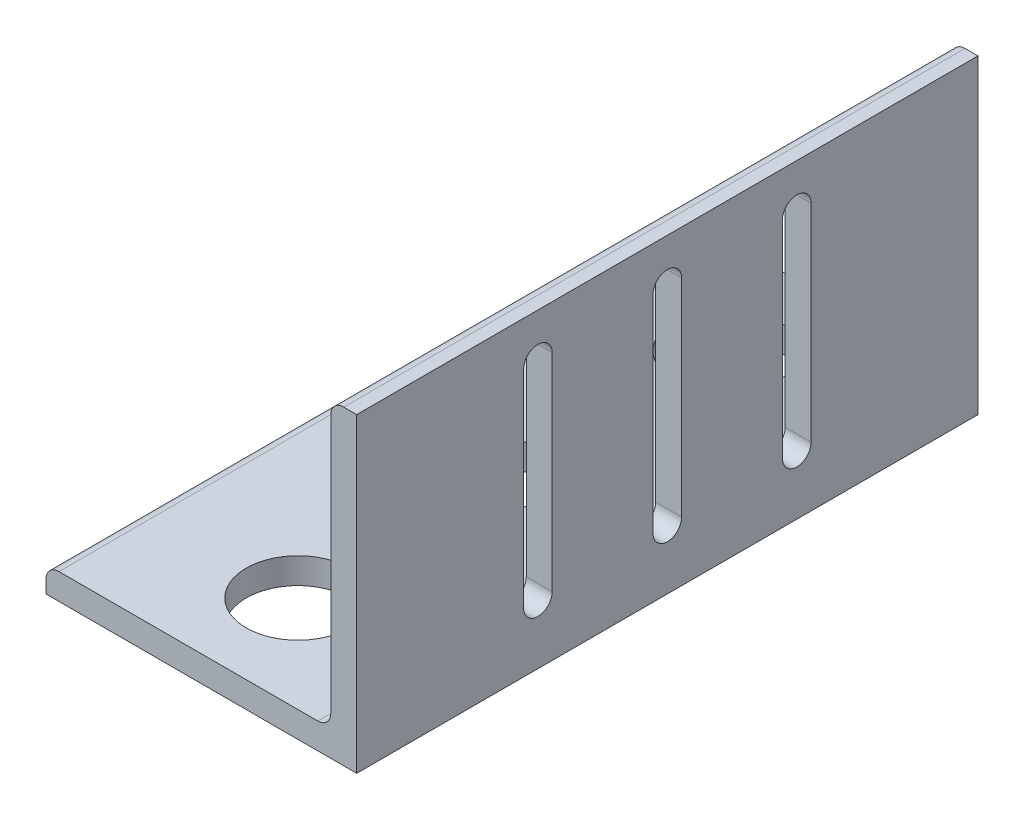
ISO-10303-21;
HEADER;
FILE_DESCRIPTION(('STEP AP214'),'2;1');
FILE_NAME('part.step','',(''),(''),'','','');
FILE_SCHEMA(('AUTOMOTIVE_DESIGN { 1 0 10303 214 1 1 1 1 }'));
ENDSEC;
DATA;
#1=APPLICATION_CONTEXT('core data for automotive mechanical design processes');
#2=APPLICATION_PROTOCOL_DEFINITION('international standard','automotive_design',2000,#1);
#3=PRODUCT_CONTEXT('',#1,'mechanical');
#4=PRODUCT('Part','Part','',(#3));
#5=PRODUCT_RELATED_PRODUCT_CATEGORY('part','',(#4));
#6=PRODUCT_DEFINITION_FORMATION('','',#4);
#7=PRODUCT_DEFINITION_CONTEXT('part definition',#1,'design');
#8=PRODUCT_DEFINITION('design','',#6,#7);
#9=PRODUCT_DEFINITION_SHAPE('','',#8);
#10=(LENGTH_UNIT() NAMED_UNIT(*) SI_UNIT(.MILLI.,.METRE.));
#11=(NAMED_UNIT(*) PLANE_ANGLE_UNIT() SI_UNIT($,.RADIAN.));
#12=(NAMED_UNIT(*) SI_UNIT($,.STERADIAN.) SOLID_ANGLE_UNIT());
#13=UNCERTAINTY_MEASURE_WITH_UNIT(LENGTH_MEASURE(1.E-05),#10,'distance_accuracy_value','');
#14=(GEOMETRIC_REPRESENTATION_CONTEXT(3) GLOBAL_UNCERTAINTY_ASSIGNED_CONTEXT((#13)) GLOBAL_UNIT_ASSIGNED_CONTEXT((#10,
#11,#12)) REPRESENTATION_CONTEXT('',''));
#15=CARTESIAN_POINT('',(0.,0.,0.));
#16=DIRECTION('',(0.,0.,1.));
#17=DIRECTION('',(1.,0.,0.));
#18=AXIS2_PLACEMENT_3D('',#15,#16,#17);
#19=CARTESIAN_POINT('',(-38.1,3.175,76.2));
#20=DIRECTION('',(1.,0.,0.));
#21=DIRECTION('',(0.,0.,-1.));
#22=AXIS2_PLACEMENT_3D('',#19,#20,#21);
#23=PLANE('',#22);
#24=DIRECTION('',(0.,-1.,0.));
#25=VECTOR('',#24,1.);
#26=CARTESIAN_POINT('',(-38.1,3.175,-76.2));
#27=LINE('',#26,#25);
#28=CARTESIAN_POINT('',(-38.1,3.175,-76.2));
#29=VERTEX_POINT('',#28);
#30=CARTESIAN_POINT('',(-38.1,0.,-76.2));
#31=VERTEX_POINT('',#30);
#32=EDGE_CURVE('E210',#29,#31,#27,.T.);
#33=ORIENTED_EDGE('',*,*,#32,.T.);
#34=DIRECTION('',(0.,0.,-1.));
#35=VECTOR('',#34,1.);
#36=CARTESIAN_POINT('',(-38.1,0.,76.2));
#37=LINE('',#36,#35);
#38=CARTESIAN_POINT('',(-38.1,0.,76.2));
#39=VERTEX_POINT('',#38);
#40=EDGE_CURVE('E312',#39,#31,#37,.T.);
#41=ORIENTED_EDGE('',*,*,#40,.F.);
#42=DIRECTION('',(0.,-1.,0.));
#43=VECTOR('',#42,1.);
#44=CARTESIAN_POINT('',(-38.1,3.175,76.2));
#45=LINE('',#44,#43);
#46=CARTESIAN_POINT('',(-38.1,3.175,76.2));
#47=VERTEX_POINT('',#46);
#48=EDGE_CURVE('E251',#47,#39,#45,.T.);
#49=ORIENTED_EDGE('',*,*,#48,.F.);
#50=DIRECTION('',(0.,0.,-1.));
#51=VECTOR('',#50,1.);
#52=CARTESIAN_POINT('',(-38.1,3.175,76.2));
#53=LINE('',#52,#51);
#54=EDGE_CURVE('E271',#47,#29,#53,.T.);
#55=ORIENTED_EDGE('',*,*,#54,.T.);
#56=EDGE_LOOP('',(#33,#41,#49,#55));
#57=FACE_BOUND('',#56,.T.);
#58=ADVANCED_FACE('F35',(#57),#23,.F.);
#59=CARTESIAN_POINT('',(-38.1,0.,76.2));
#60=DIRECTION('',(0.,1.,0.));
#61=DIRECTION('',(0.,0.,1.));
#62=AXIS2_PLACEMENT_3D('',#59,#60,#61);
#63=PLANE('',#62);
#64=CARTESIAN_POINT('',(0.,0.,-52.5));
#65=DIRECTION('',(0.,-1.,0.));
#66=DIRECTION('',(0.,0.,-1.));
#67=AXIS2_PLACEMENT_3D('',#64,#65,#66);
#68=CIRCLE('',#67,12.7);
#69=CARTESIAN_POINT('',(0.,0.,-65.2));
#70=VERTEX_POINT('',#69);
#71=EDGE_CURVE('E494',#70,#70,#68,.T.);
#72=ORIENTED_EDGE('',*,*,#71,.F.);
#73=EDGE_LOOP('',(#72));
#74=FACE_BOUND('',#73,.T.);
#75=CARTESIAN_POINT('',(0.,0.,52.5));
#76=DIRECTION('',(0.,-1.,0.));
#77=DIRECTION('',(0.,0.,-1.));
#78=AXIS2_PLACEMENT_3D('',#75,#76,#77);
#79=CIRCLE('',#78,12.7);
#80=CARTESIAN_POINT('',(0.,0.,39.8));
#81=VERTEX_POINT('',#80);
#82=EDGE_CURVE('E491',#81,#81,#79,.T.);
#83=ORIENTED_EDGE('',*,*,#82,.F.);
#84=EDGE_LOOP('',(#83));
#85=FACE_BOUND('',#84,.T.);
#86=CARTESIAN_POINT('',(0.,0.,0.));
#87=DIRECTION('',(0.,-1.,0.));
#88=DIRECTION('',(0.,0.,-1.));
#89=AXIS2_PLACEMENT_3D('',#86,#87,#88);
#90=CIRCLE('',#89,10.);
#91=CARTESIAN_POINT('',(0.,0.,-10.));
#92=VERTEX_POINT('',#91);
#93=EDGE_CURVE('E347',#92,#92,#90,.T.);
#94=ORIENTED_EDGE('',*,*,#93,.F.);
#95=EDGE_LOOP('',(#94));
#96=FACE_BOUND('',#95,.T.);
#97=DIRECTION('',(1.,0.,0.));
#98=VECTOR('',#97,1.);
#99=CARTESIAN_POINT('',(-38.1,0.,-76.2));
#100=LINE('',#99,#98);
#101=CARTESIAN_POINT('',(38.1,0.,-76.2));
#102=VERTEX_POINT('',#101);
#103=EDGE_CURVE('E274',#31,#102,#100,.T.);
#104=ORIENTED_EDGE('',*,*,#103,.T.);
#105=DIRECTION('',(0.,0.,-1.));
#106=VECTOR('',#105,1.);
#107=CARTESIAN_POINT('',(38.1,0.,76.2));
#108=LINE('',#107,#106);
#109=CARTESIAN_POINT('',(38.1,0.,76.2));
#110=VERTEX_POINT('',#109);
#111=EDGE_CURVE('E309',#110,#102,#108,.T.);
#112=ORIENTED_EDGE('',*,*,#111,.F.);
#113=DIRECTION('',(1.,0.,0.));
#114=VECTOR('',#113,1.);
#115=CARTESIAN_POINT('',(-38.1,0.,76.2));
#116=LINE('',#115,#114);
#117=EDGE_CURVE('E254',#39,#110,#116,.T.);
#118=ORIENTED_EDGE('',*,*,#117,.F.);
#119=ORIENTED_EDGE('',*,*,#40,.T.);
#120=EDGE_LOOP('',(#104,#112,#118,#119));
#121=FACE_BOUND('',#120,.T.);
#122=ADVANCED_FACE('F370',(#74,#85,#96,#121),#63,.F.);
#123=CARTESIAN_POINT('',(38.1,0.,76.2));
#124=DIRECTION('',(-1.,0.,0.));
#125=DIRECTION('',(0.,0.,1.));
#126=AXIS2_PLACEMENT_3D('',#123,#124,#125);
#127=PLANE('',#126);
#128=DIRECTION('',(0.,-1.,0.));
#129=VECTOR('',#128,1.);
#130=CARTESIAN_POINT('',(38.1,65.4,35.25));
#131=LINE('',#130,#129);
#132=CARTESIAN_POINT('',(38.1,65.4,35.25));
#133=VERTEX_POINT('',#132);
#134=CARTESIAN_POINT('',(38.1,14.6,35.25));
#135=VERTEX_POINT('',#134);
#136=EDGE_CURVE('E196',#133,#135,#131,.T.);
#137=ORIENTED_EDGE('',*,*,#136,.F.);
#138=CARTESIAN_POINT('',(38.1,65.4,31.75));
#139=DIRECTION('',(1.,0.,0.));
#140=DIRECTION('',(0.,1.,0.));
#141=AXIS2_PLACEMENT_3D('',#138,#139,#140);
#142=CIRCLE('',#141,3.5);
#143=CARTESIAN_POINT('',(38.1,65.4,28.25));
#144=VERTEX_POINT('',#143);
#145=EDGE_CURVE('E51',#144,#133,#142,.T.);
#146=ORIENTED_EDGE('',*,*,#145,.F.);
#147=DIRECTION('',(0.,1.,0.));
#148=VECTOR('',#147,1.);
#149=CARTESIAN_POINT('',(38.1,65.4,28.25));
#150=LINE('',#149,#148);
#151=CARTESIAN_POINT('',(38.1,14.6,28.25));
#152=VERTEX_POINT('',#151);
#153=EDGE_CURVE('E203',#152,#144,#150,.T.);
#154=ORIENTED_EDGE('',*,*,#153,.F.);
#155=CARTESIAN_POINT('',(38.1,14.6,31.75));
#156=DIRECTION('',(1.,0.,0.));
#157=DIRECTION('',(0.,1.,0.));
#158=AXIS2_PLACEMENT_3D('',#155,#156,#157);
#159=CIRCLE('',#158,3.5);
#160=EDGE_CURVE('E186',#135,#152,#159,.T.);
#161=ORIENTED_EDGE('',*,*,#160,.F.);
#162=EDGE_LOOP('',(#137,#146,#154,#161));
#163=FACE_BOUND('',#162,.T.);
#164=DIRECTION('',(0.,-1.,0.));
#165=VECTOR('',#164,1.);
#166=CARTESIAN_POINT('',(38.1,65.4,-28.25));
#167=LINE('',#166,#165);
#168=CARTESIAN_POINT('',(38.1,65.4,-28.25));
#169=VERTEX_POINT('',#168);
#170=CARTESIAN_POINT('',(38.1,14.6,-28.25));
#171=VERTEX_POINT('',#170);
#172=EDGE_CURVE('E214',#169,#171,#167,.T.);
#173=ORIENTED_EDGE('',*,*,#172,.F.);
#174=CARTESIAN_POINT('',(38.1,65.4,-31.75));
#175=DIRECTION('',(1.,0.,0.));
#176=DIRECTION('',(0.,-1.,0.));
#177=AXIS2_PLACEMENT_3D('',#174,#175,#176);
#178=CIRCLE('',#177,3.5);
#179=CARTESIAN_POINT('',(38.1,65.4,-35.25));
#180=VERTEX_POINT('',#179);
#181=EDGE_CURVE('E59',#180,#169,#178,.T.);
#182=ORIENTED_EDGE('',*,*,#181,.F.);
#183=DIRECTION('',(0.,1.,0.));
#184=VECTOR('',#183,1.);
#185=CARTESIAN_POINT('',(38.1,65.4,-35.25));
#186=LINE('',#185,#184);
#187=CARTESIAN_POINT('',(38.1,14.6,-35.25));
#188=VERTEX_POINT('',#187);
#189=EDGE_CURVE('E221',#188,#180,#186,.T.);
#190=ORIENTED_EDGE('',*,*,#189,.F.);
#191=CARTESIAN_POINT('',(38.1,14.6,-31.75));
#192=DIRECTION('',(1.,0.,0.));
#193=DIRECTION('',(0.,-1.,0.));
#194=AXIS2_PLACEMENT_3D('',#191,#192,#193);
#195=CIRCLE('',#194,3.5);
#196=EDGE_CURVE('E218',#171,#188,#195,.T.);
#197=ORIENTED_EDGE('',*,*,#196,.F.);
#198=EDGE_LOOP('',(#173,#182,#190,#197));
#199=FACE_BOUND('',#198,.T.);
#200=DIRECTION('',(0.,-1.,0.));
#201=VECTOR('',#200,1.);
#202=CARTESIAN_POINT('',(38.1,65.4,3.50000000000001));
#203=LINE('',#202,#201);
#204=CARTESIAN_POINT('',(38.1,65.4,3.50000000000001));
#205=VERTEX_POINT('',#204);
#206=CARTESIAN_POINT('',(38.1,14.6,3.50000000000003));
#207=VERTEX_POINT('',#206);
#208=EDGE_CURVE('E234',#205,#207,#203,.T.);
#209=ORIENTED_EDGE('',*,*,#208,.F.);
#210=CARTESIAN_POINT('',(38.1,65.4,0.));
#211=DIRECTION('',(1.,0.,0.));
#212=DIRECTION('',(0.,1.,0.));
#213=AXIS2_PLACEMENT_3D('',#210,#211,#212);
#214=CIRCLE('',#213,3.5);
#215=CARTESIAN_POINT('',(38.1,65.4,-3.5));
#216=VERTEX_POINT('',#215);
#217=EDGE_CURVE('E232',#216,#205,#214,.T.);
#218=ORIENTED_EDGE('',*,*,#217,.F.);
#219=DIRECTION('',(0.,1.,0.));
#220=VECTOR('',#219,1.);
#221=CARTESIAN_POINT('',(38.1,65.4,-3.5));
#222=LINE('',#221,#220);
#223=CARTESIAN_POINT('',(38.1,14.6,-3.49999999999998));
#224=VERTEX_POINT('',#223);
#225=EDGE_CURVE('E240',#224,#216,#222,.T.);
#226=ORIENTED_EDGE('',*,*,#225,.F.);
#227=CARTESIAN_POINT('',(38.1,14.6,0.));
#228=DIRECTION('',(1.,0.,0.));
#229=DIRECTION('',(0.,1.,0.));
#230=AXIS2_PLACEMENT_3D('',#227,#228,#229);
#231=CIRCLE('',#230,3.5);
#232=EDGE_CURVE('E237',#207,#224,#231,.T.);
#233=ORIENTED_EDGE('',*,*,#232,.F.);
#234=EDGE_LOOP('',(#209,#218,#226,#233));
#235=FACE_BOUND('',#234,.T.);
#236=DIRECTION('',(0.,1.,0.));
#237=VECTOR('',#236,1.);
#238=CARTESIAN_POINT('',(38.1,0.,-76.2));
#239=LINE('',#238,#237);
#240=CARTESIAN_POINT('',(38.1,76.2,-76.2));
#241=VERTEX_POINT('',#240);
#242=EDGE_CURVE('E276',#102,#241,#239,.T.);
#243=ORIENTED_EDGE('',*,*,#242,.T.);
#244=DIRECTION('',(0.,0.,-1.));
#245=VECTOR('',#244,1.);
#246=CARTESIAN_POINT('',(38.1,76.2,76.2));
#247=LINE('',#246,#245);
#248=CARTESIAN_POINT('',(38.1,76.2,76.2));
#249=VERTEX_POINT('',#248);
#250=EDGE_CURVE('E306',#249,#241,#247,.T.);
#251=ORIENTED_EDGE('',*,*,#250,.F.);
#252=DIRECTION('',(0.,1.,0.));
#253=VECTOR('',#252,1.);
#254=CARTESIAN_POINT('',(38.1,0.,76.2));
#255=LINE('',#254,#253);
#256=EDGE_CURVE('E257',#110,#249,#255,.T.);
#257=ORIENTED_EDGE('',*,*,#256,.F.);
#258=ORIENTED_EDGE('',*,*,#111,.T.);
#259=EDGE_LOOP('',(#243,#251,#257,#258));
#260=FACE_BOUND('',#259,.T.);
#261=ADVANCED_FACE('F200',(#163,#199,#235,#260),#127,.F.);
#262=CARTESIAN_POINT('',(34.925,76.2,76.2));
#263=DIRECTION('',(0.,-1.,0.));
#264=DIRECTION('',(0.,0.,-1.));
#265=AXIS2_PLACEMENT_3D('',#262,#263,#264);
#266=PLANE('',#265);
#267=DIRECTION('',(-1.,0.,0.));
#268=VECTOR('',#267,1.);
#269=CARTESIAN_POINT('',(34.925,76.2,-76.2));
#270=LINE('',#269,#268);
#271=CARTESIAN_POINT('',(34.925,76.2,-76.2));
#272=VERTEX_POINT('',#271);
#273=EDGE_CURVE('E278',#241,#272,#270,.T.);
#274=ORIENTED_EDGE('',*,*,#273,.T.);
#275=DIRECTION('',(0.,0.,-1.));
#276=VECTOR('',#275,1.);
#277=CARTESIAN_POINT('',(34.925,76.2,76.2));
#278=LINE('',#277,#276);
#279=CARTESIAN_POINT('',(34.925,76.2,76.2));
#280=VERTEX_POINT('',#279);
#281=EDGE_CURVE('E303',#280,#272,#278,.T.);
#282=ORIENTED_EDGE('',*,*,#281,.F.);
#283=DIRECTION('',(-1.,0.,0.));
#284=VECTOR('',#283,1.);
#285=CARTESIAN_POINT('',(34.925,76.2,76.2));
#286=LINE('',#285,#284);
#287=EDGE_CURVE('E259',#249,#280,#286,.T.);
#288=ORIENTED_EDGE('',*,*,#287,.F.);
#289=ORIENTED_EDGE('',*,*,#250,.T.);
#290=EDGE_LOOP('',(#274,#282,#288,#289));
#291=FACE_BOUND('',#290,.T.);
#292=ADVANCED_FACE('F414',(#291),#266,.F.);
#293=CARTESIAN_POINT('',(34.925,73.025,76.2));
#294=DIRECTION('',(0.,0.,-1.));
#295=DIRECTION('',(-1.,0.,0.));
#296=AXIS2_PLACEMENT_3D('',#293,#294,#295);
#297=CYLINDRICAL_SURFACE('',#296,3.175);
#298=CARTESIAN_POINT('',(34.925,73.025,-76.2));
#299=DIRECTION('',(0.,0.,1.));
#300=DIRECTION('',(-1.,0.,0.));
#301=AXIS2_PLACEMENT_3D('',#298,#299,#300);
#302=CIRCLE('',#301,3.175);
#303=CARTESIAN_POINT('',(31.75,73.025,-76.2));
#304=VERTEX_POINT('',#303);
#305=EDGE_CURVE('E280',#272,#304,#302,.T.);
#306=ORIENTED_EDGE('',*,*,#305,.T.);
#307=DIRECTION('',(0.,0.,-1.));
#308=VECTOR('',#307,1.);
#309=CARTESIAN_POINT('',(31.75,73.025,76.2));
#310=LINE('',#309,#308);
#311=CARTESIAN_POINT('',(31.75,73.025,76.2));
#312=VERTEX_POINT('',#311);
#313=EDGE_CURVE('E300',#312,#304,#310,.T.);
#314=ORIENTED_EDGE('',*,*,#313,.F.);
#315=CARTESIAN_POINT('',(34.925,73.025,76.2));
#316=DIRECTION('',(0.,0.,1.));
#317=DIRECTION('',(-1.,0.,0.));
#318=AXIS2_PLACEMENT_3D('',#315,#316,#317);
#319=CIRCLE('',#318,3.175);
#320=EDGE_CURVE('E261',#280,#312,#319,.T.);
#321=ORIENTED_EDGE('',*,*,#320,.F.);
#322=ORIENTED_EDGE('',*,*,#281,.T.);
#323=EDGE_LOOP('',(#306,#314,#321,#322));
#324=FACE_BOUND('',#323,.T.);
#325=ADVANCED_FACE('F411',(#324),#297,.T.);
#326=CARTESIAN_POINT('',(31.75,73.025,76.2));
#327=DIRECTION('',(1.,0.,0.));
#328=DIRECTION('',(0.,1.,0.));
#329=AXIS2_PLACEMENT_3D('',#326,#327,#328);
#330=PLANE('',#329);
#331=DIRECTION('',(0.,1.,0.));
#332=VECTOR('',#331,1.);
#333=CARTESIAN_POINT('',(31.75,73.025,28.25));
#334=LINE('',#333,#332);
#335=CARTESIAN_POINT('',(31.75,14.6,28.25));
#336=VERTEX_POINT('',#335);
#337=CARTESIAN_POINT('',(31.75,65.4,28.25));
#338=VERTEX_POINT('',#337);
#339=EDGE_CURVE('E43',#336,#338,#334,.T.);
#340=ORIENTED_EDGE('',*,*,#339,.T.);
#341=CARTESIAN_POINT('',(31.75,65.4,31.75));
#342=DIRECTION('',(1.,0.,0.));
#343=DIRECTION('',(0.,1.,0.));
#344=AXIS2_PLACEMENT_3D('',#341,#342,#343);
#345=CIRCLE('',#344,3.5);
#346=CARTESIAN_POINT('',(31.75,65.4,35.25));
#347=VERTEX_POINT('',#346);
#348=EDGE_CURVE('E11',#338,#347,#345,.T.);
#349=ORIENTED_EDGE('',*,*,#348,.T.);
#350=DIRECTION('',(0.,-1.,0.));
#351=VECTOR('',#350,1.);
#352=CARTESIAN_POINT('',(31.75,73.025,35.25));
#353=LINE('',#352,#351);
#354=CARTESIAN_POINT('',(31.75,14.6,35.25));
#355=VERTEX_POINT('',#354);
#356=EDGE_CURVE('E339',#347,#355,#353,.T.);
#357=ORIENTED_EDGE('',*,*,#356,.T.);
#358=CARTESIAN_POINT('',(31.75,14.6,31.75));
#359=DIRECTION('',(1.,0.,0.));
#360=DIRECTION('',(0.,1.,0.));
#361=AXIS2_PLACEMENT_3D('',#358,#359,#360);
#362=CIRCLE('',#361,3.5);
#363=EDGE_CURVE('E189',#355,#336,#362,.T.);
#364=ORIENTED_EDGE('',*,*,#363,.T.);
#365=EDGE_LOOP('',(#340,#349,#357,#364));
#366=FACE_BOUND('',#365,.T.);
#367=DIRECTION('',(0.,1.,0.));
#368=VECTOR('',#367,1.);
#369=CARTESIAN_POINT('',(31.75,73.025,-35.25));
#370=LINE('',#369,#368);
#371=CARTESIAN_POINT('',(31.75,14.6,-35.25));
#372=VERTEX_POINT('',#371);
#373=CARTESIAN_POINT('',(31.75,65.4,-35.25));
#374=VERTEX_POINT('',#373);
#375=EDGE_CURVE('E333',#372,#374,#370,.T.);
#376=ORIENTED_EDGE('',*,*,#375,.T.);
#377=CARTESIAN_POINT('',(31.75,65.4,-31.75));
#378=DIRECTION('',(1.,0.,0.));
#379=DIRECTION('',(0.,1.,0.));
#380=AXIS2_PLACEMENT_3D('',#377,#378,#379);
#381=CIRCLE('',#380,3.5);
#382=CARTESIAN_POINT('',(31.75,65.4,-28.25));
#383=VERTEX_POINT('',#382);
#384=EDGE_CURVE('E336',#374,#383,#381,.T.);
#385=ORIENTED_EDGE('',*,*,#384,.T.);
#386=DIRECTION('',(0.,-1.,0.));
#387=VECTOR('',#386,1.);
#388=CARTESIAN_POINT('',(31.75,73.025,-28.25));
#389=LINE('',#388,#387);
#390=CARTESIAN_POINT('',(31.75,14.6,-28.25));
#391=VERTEX_POINT('',#390);
#392=EDGE_CURVE('E327',#383,#391,#389,.T.);
#393=ORIENTED_EDGE('',*,*,#392,.T.);
#394=CARTESIAN_POINT('',(31.75,14.6,-31.75));
#395=DIRECTION('',(1.,0.,0.));
#396=DIRECTION('',(0.,1.,0.));
#397=AXIS2_PLACEMENT_3D('',#394,#395,#396);
#398=CIRCLE('',#397,3.5);
#399=EDGE_CURVE('E330',#391,#372,#398,.T.);
#400=ORIENTED_EDGE('',*,*,#399,.T.);
#401=EDGE_LOOP('',(#376,#385,#393,#400));
#402=FACE_BOUND('',#401,.T.);
#403=DIRECTION('',(0.,1.,0.));
#404=VECTOR('',#403,1.);
#405=CARTESIAN_POINT('',(31.75,73.025,-3.49999999999999));
#406=LINE('',#405,#404);
#407=CARTESIAN_POINT('',(31.75,14.6,-3.49999999999998));
#408=VERTEX_POINT('',#407);
#409=CARTESIAN_POINT('',(31.75,65.4,-3.5));
#410=VERTEX_POINT('',#409);
#411=EDGE_CURVE('E321',#408,#410,#406,.T.);
#412=ORIENTED_EDGE('',*,*,#411,.T.);
#413=CARTESIAN_POINT('',(31.75,65.4,0.));
#414=DIRECTION('',(1.,0.,0.));
#415=DIRECTION('',(0.,1.,0.));
#416=AXIS2_PLACEMENT_3D('',#413,#414,#415);
#417=CIRCLE('',#416,3.5);
#418=CARTESIAN_POINT('',(31.75,65.4,3.50000000000001));
#419=VERTEX_POINT('',#418);
#420=EDGE_CURVE('E324',#410,#419,#417,.T.);
#421=ORIENTED_EDGE('',*,*,#420,.T.);
#422=DIRECTION('',(0.,-1.,0.));
#423=VECTOR('',#422,1.);
#424=CARTESIAN_POINT('',(31.75,73.025,3.5));
#425=LINE('',#424,#423);
#426=CARTESIAN_POINT('',(31.75,14.6,3.50000000000003));
#427=VERTEX_POINT('',#426);
#428=EDGE_CURVE('E315',#419,#427,#425,.T.);
#429=ORIENTED_EDGE('',*,*,#428,.T.);
#430=CARTESIAN_POINT('',(31.75,14.6,0.));
#431=DIRECTION('',(1.,0.,0.));
#432=DIRECTION('',(0.,1.,0.));
#433=AXIS2_PLACEMENT_3D('',#430,#431,#432);
#434=CIRCLE('',#433,3.5);
#435=EDGE_CURVE('E318',#427,#408,#434,.T.);
#436=ORIENTED_EDGE('',*,*,#435,.T.);
#437=EDGE_LOOP('',(#412,#421,#429,#436));
#438=FACE_BOUND('',#437,.T.);
#439=DIRECTION('',(0.,-1.,0.));
#440=VECTOR('',#439,1.);
#441=CARTESIAN_POINT('',(31.75,73.025,-76.2));
#442=LINE('',#441,#440);
#443=CARTESIAN_POINT('',(31.75,9.52499999999999,-76.2));
#444=VERTEX_POINT('',#443);
#445=EDGE_CURVE('E282',#304,#444,#442,.T.);
#446=ORIENTED_EDGE('',*,*,#445,.T.);
#447=DIRECTION('',(0.,0.,-1.));
#448=VECTOR('',#447,1.);
#449=CARTESIAN_POINT('',(31.75,9.52499999999999,76.2));
#450=LINE('',#449,#448);
#451=CARTESIAN_POINT('',(31.75,9.52499999999999,76.2));
#452=VERTEX_POINT('',#451);
#453=EDGE_CURVE('E297',#452,#444,#450,.T.);
#454=ORIENTED_EDGE('',*,*,#453,.F.);
#455=DIRECTION('',(0.,-1.,0.));
#456=VECTOR('',#455,1.);
#457=CARTESIAN_POINT('',(31.75,73.025,76.2));
#458=LINE('',#457,#456);
#459=EDGE_CURVE('E263',#312,#452,#458,.T.);
#460=ORIENTED_EDGE('',*,*,#459,.F.);
#461=ORIENTED_EDGE('',*,*,#313,.T.);
#462=EDGE_LOOP('',(#446,#454,#460,#461));
#463=FACE_BOUND('',#462,.T.);
#464=ADVANCED_FACE('F407',(#366,#402,#438,#463),#330,.F.);
#465=CARTESIAN_POINT('',(28.575,9.52499999999999,76.2));
#466=DIRECTION('',(0.,0.,-1.));
#467=DIRECTION('',(-1.,0.,0.));
#468=AXIS2_PLACEMENT_3D('',#465,#466,#467);
#469=CYLINDRICAL_SURFACE('',#468,3.175);
#470=CARTESIAN_POINT('',(28.575,9.52499999999999,-76.2));
#471=DIRECTION('',(0.,0.,-1.));
#472=DIRECTION('',(-1.,0.,0.));
#473=AXIS2_PLACEMENT_3D('',#470,#471,#472);
#474=CIRCLE('',#473,3.175);
#475=CARTESIAN_POINT('',(28.575,6.35,-76.2));
#476=VERTEX_POINT('',#475);
#477=EDGE_CURVE('E284',#444,#476,#474,.T.);
#478=ORIENTED_EDGE('',*,*,#477,.T.);
#479=DIRECTION('',(0.,0.,-1.));
#480=VECTOR('',#479,1.);
#481=CARTESIAN_POINT('',(28.575,6.35,76.2));
#482=LINE('',#481,#480);
#483=CARTESIAN_POINT('',(28.575,6.35,76.2));
#484=VERTEX_POINT('',#483);
#485=EDGE_CURVE('E294',#484,#476,#482,.T.);
#486=ORIENTED_EDGE('',*,*,#485,.F.);
#487=CARTESIAN_POINT('',(28.575,9.52499999999999,76.2));
#488=DIRECTION('',(0.,0.,-1.));
#489=DIRECTION('',(-1.,0.,0.));
#490=AXIS2_PLACEMENT_3D('',#487,#488,#489);
#491=CIRCLE('',#490,3.175);
#492=EDGE_CURVE('E265',#452,#484,#491,.T.);
#493=ORIENTED_EDGE('',*,*,#492,.F.);
#494=ORIENTED_EDGE('',*,*,#453,.T.);
#495=EDGE_LOOP('',(#478,#486,#493,#494));
#496=FACE_BOUND('',#495,.T.);
#497=ADVANCED_FACE('F402',(#496),#469,.F.);
#498=CARTESIAN_POINT('',(28.575,6.35,76.2));
#499=DIRECTION('',(0.,-1.,0.));
#500=DIRECTION('',(1.,0.,0.));
#501=AXIS2_PLACEMENT_3D('',#498,#499,#500);
#502=PLANE('',#501);
#503=CARTESIAN_POINT('',(0.,6.35,-52.5));
#504=DIRECTION('',(0.,-1.,0.));
#505=DIRECTION('',(1.,0.,0.));
#506=AXIS2_PLACEMENT_3D('',#503,#504,#505);
#507=CIRCLE('',#506,12.7);
#508=CARTESIAN_POINT('',(12.7,6.35,-52.5));
#509=VERTEX_POINT('',#508);
#510=EDGE_CURVE('E38',#509,#509,#507,.T.);
#511=ORIENTED_EDGE('',*,*,#510,.T.);
#512=EDGE_LOOP('',(#511));
#513=FACE_BOUND('',#512,.T.);
#514=CARTESIAN_POINT('',(0.,6.35,52.5));
#515=DIRECTION('',(0.,-1.,0.));
#516=DIRECTION('',(1.,0.,0.));
#517=AXIS2_PLACEMENT_3D('',#514,#515,#516);
#518=CIRCLE('',#517,12.7);
#519=CARTESIAN_POINT('',(12.7,6.35,52.5));
#520=VERTEX_POINT('',#519);
#521=EDGE_CURVE('E346',#520,#520,#518,.T.);
#522=ORIENTED_EDGE('',*,*,#521,.T.);
#523=EDGE_LOOP('',(#522));
#524=FACE_BOUND('',#523,.T.);
#525=CARTESIAN_POINT('',(0.,6.35,0.));
#526=DIRECTION('',(0.,-1.,0.));
#527=DIRECTION('',(1.,0.,0.));
#528=AXIS2_PLACEMENT_3D('',#525,#526,#527);
#529=CIRCLE('',#528,10.);
#530=CARTESIAN_POINT('',(10.,6.35,0.));
#531=VERTEX_POINT('',#530);
#532=EDGE_CURVE('E344',#531,#531,#529,.T.);
#533=ORIENTED_EDGE('',*,*,#532,.T.);
#534=EDGE_LOOP('',(#533));
#535=FACE_BOUND('',#534,.T.);
#536=DIRECTION('',(-1.,0.,0.));
#537=VECTOR('',#536,1.);
#538=CARTESIAN_POINT('',(28.575,6.35,-76.2));
#539=LINE('',#538,#537);
#540=CARTESIAN_POINT('',(-34.925,6.34999999999999,-76.2));
#541=VERTEX_POINT('',#540);
#542=EDGE_CURVE('E286',#476,#541,#539,.T.);
#543=ORIENTED_EDGE('',*,*,#542,.T.);
#544=DIRECTION('',(0.,0.,-1.));
#545=VECTOR('',#544,1.);
#546=CARTESIAN_POINT('',(-34.925,6.34999999999999,76.2));
#547=LINE('',#546,#545);
#548=CARTESIAN_POINT('',(-34.925,6.34999999999999,76.2));
#549=VERTEX_POINT('',#548);
#550=EDGE_CURVE('E291',#549,#541,#547,.T.);
#551=ORIENTED_EDGE('',*,*,#550,.F.);
#552=DIRECTION('',(-1.,0.,0.));
#553=VECTOR('',#552,1.);
#554=CARTESIAN_POINT('',(28.575,6.35,76.2));
#555=LINE('',#554,#553);
#556=EDGE_CURVE('E267',#484,#549,#555,.T.);
#557=ORIENTED_EDGE('',*,*,#556,.F.);
#558=ORIENTED_EDGE('',*,*,#485,.T.);
#559=EDGE_LOOP('',(#543,#551,#557,#558));
#560=FACE_BOUND('',#559,.T.);
#561=ADVANCED_FACE('F354',(#513,#524,#535,#560),#502,.F.);
#562=CARTESIAN_POINT('',(-34.925,3.175,76.2));
#563=DIRECTION('',(0.,0.,-1.));
#564=DIRECTION('',(-1.,0.,0.));
#565=AXIS2_PLACEMENT_3D('',#562,#563,#564);
#566=CYLINDRICAL_SURFACE('',#565,3.175);
#567=CARTESIAN_POINT('',(-34.925,3.175,-76.2));
#568=DIRECTION('',(0.,0.,1.));
#569=DIRECTION('',(-1.,0.,0.));
#570=AXIS2_PLACEMENT_3D('',#567,#568,#569);
#571=CIRCLE('',#570,3.175);
#572=EDGE_CURVE('E255',#541,#29,#571,.T.);
#573=ORIENTED_EDGE('',*,*,#572,.T.);
#574=ORIENTED_EDGE('',*,*,#54,.F.);
#575=CARTESIAN_POINT('',(-34.925,3.175,76.2));
#576=DIRECTION('',(0.,0.,1.));
#577=DIRECTION('',(-1.,0.,0.));
#578=AXIS2_PLACEMENT_3D('',#575,#576,#577);
#579=CIRCLE('',#578,3.175);
#580=EDGE_CURVE('E269',#549,#47,#579,.T.);
#581=ORIENTED_EDGE('',*,*,#580,.F.);
#582=ORIENTED_EDGE('',*,*,#550,.T.);
#583=EDGE_LOOP('',(#573,#574,#581,#582));
#584=FACE_BOUND('',#583,.T.);
#585=ADVANCED_FACE('F395',(#584),#566,.T.);
#586=CARTESIAN_POINT('',(34.925,73.025,76.2));
#587=DIRECTION('',(0.,0.,-1.));
#588=DIRECTION('',(-1.,0.,0.));
#589=AXIS2_PLACEMENT_3D('',#586,#587,#588);
#590=PLANE('',#589);
#591=ORIENTED_EDGE('',*,*,#48,.T.);
#592=ORIENTED_EDGE('',*,*,#117,.T.);
#593=ORIENTED_EDGE('',*,*,#256,.T.);
#594=ORIENTED_EDGE('',*,*,#287,.T.);
#595=ORIENTED_EDGE('',*,*,#320,.T.);
#596=ORIENTED_EDGE('',*,*,#459,.T.);
#597=ORIENTED_EDGE('',*,*,#492,.T.);
#598=ORIENTED_EDGE('',*,*,#556,.T.);
#599=ORIENTED_EDGE('',*,*,#580,.T.);
#600=EDGE_LOOP('',(#591,#592,#593,#594,#595,#596,#597,#598,#599));
#601=FACE_BOUND('',#600,.T.);
#602=ADVANCED_FACE('F390',(#601),#590,.F.);
#603=CARTESIAN_POINT('',(34.925,73.025,-76.2));
#604=DIRECTION('',(0.,0.,-1.));
#605=DIRECTION('',(-1.,0.,0.));
#606=AXIS2_PLACEMENT_3D('',#603,#604,#605);
#607=PLANE('',#606);
#608=ORIENTED_EDGE('',*,*,#32,.F.);
#609=ORIENTED_EDGE('',*,*,#572,.F.);
#610=ORIENTED_EDGE('',*,*,#542,.F.);
#611=ORIENTED_EDGE('',*,*,#477,.F.);
#612=ORIENTED_EDGE('',*,*,#445,.F.);
#613=ORIENTED_EDGE('',*,*,#305,.F.);
#614=ORIENTED_EDGE('',*,*,#273,.F.);
#615=ORIENTED_EDGE('',*,*,#242,.F.);
#616=ORIENTED_EDGE('',*,*,#103,.F.);
#617=EDGE_LOOP('',(#608,#609,#610,#611,#612,#613,#614,#615,#616));
#618=FACE_BOUND('',#617,.T.);
#619=ADVANCED_FACE('F382',(#618),#607,.T.);
#620=CARTESIAN_POINT('',(28.1,65.4,0.));
#621=DIRECTION('',(1.,0.,0.));
#622=DIRECTION('',(0.,1.,0.));
#623=AXIS2_PLACEMENT_3D('',#620,#621,#622);
#624=CYLINDRICAL_SURFACE('',#623,3.5);
#625=DIRECTION('',(1.,0.,0.));
#626=VECTOR('',#625,1.);
#627=CARTESIAN_POINT('',(28.1,65.4,-3.5));
#628=LINE('',#627,#626);
#629=EDGE_CURVE('E215',#410,#216,#628,.T.);
#630=ORIENTED_EDGE('',*,*,#629,.T.);
#631=ORIENTED_EDGE('',*,*,#217,.T.);
#632=DIRECTION('',(1.,0.,0.));
#633=VECTOR('',#632,1.);
#634=CARTESIAN_POINT('',(28.1,65.4,3.50000000000001));
#635=LINE('',#634,#633);
#636=EDGE_CURVE('E243',#419,#205,#635,.T.);
#637=ORIENTED_EDGE('',*,*,#636,.F.);
#638=ORIENTED_EDGE('',*,*,#420,.F.);
#639=EDGE_LOOP('',(#630,#631,#637,#638));
#640=FACE_BOUND('',#639,.T.);
#641=ADVANCED_FACE('F438',(#640),#624,.F.);
#642=CARTESIAN_POINT('',(28.1,65.4,-3.5));
#643=DIRECTION('',(0.,0.,-1.));
#644=DIRECTION('',(0.,1.,0.));
#645=AXIS2_PLACEMENT_3D('',#642,#643,#644);
#646=PLANE('',#645);
#647=DIRECTION('',(1.,0.,0.));
#648=VECTOR('',#647,1.);
#649=CARTESIAN_POINT('',(28.1,14.6,-3.49999999999998));
#650=LINE('',#649,#648);
#651=EDGE_CURVE('E245',#408,#224,#650,.T.);
#652=ORIENTED_EDGE('',*,*,#651,.T.);
#653=ORIENTED_EDGE('',*,*,#225,.T.);
#654=ORIENTED_EDGE('',*,*,#629,.F.);
#655=ORIENTED_EDGE('',*,*,#411,.F.);
#656=EDGE_LOOP('',(#652,#653,#654,#655));
#657=FACE_BOUND('',#656,.T.);
#658=ADVANCED_FACE('F443',(#657),#646,.F.);
#659=CARTESIAN_POINT('',(28.1,14.6,0.));
#660=DIRECTION('',(1.,0.,0.));
#661=DIRECTION('',(0.,1.,0.));
#662=AXIS2_PLACEMENT_3D('',#659,#660,#661);
#663=CYLINDRICAL_SURFACE('',#662,3.5);
#664=DIRECTION('',(1.,0.,0.));
#665=VECTOR('',#664,1.);
#666=CARTESIAN_POINT('',(28.1,14.6,3.50000000000003));
#667=LINE('',#666,#665);
#668=EDGE_CURVE('E247',#427,#207,#667,.T.);
#669=ORIENTED_EDGE('',*,*,#668,.T.);
#670=ORIENTED_EDGE('',*,*,#232,.T.);
#671=ORIENTED_EDGE('',*,*,#651,.F.);
#672=ORIENTED_EDGE('',*,*,#435,.F.);
#673=EDGE_LOOP('',(#669,#670,#671,#672));
#674=FACE_BOUND('',#673,.T.);
#675=ADVANCED_FACE('F449',(#674),#663,.F.);
#676=CARTESIAN_POINT('',(28.1,65.4,3.50000000000001));
#677=DIRECTION('',(0.,0.,1.));
#678=DIRECTION('',(0.,-1.,0.));
#679=AXIS2_PLACEMENT_3D('',#676,#677,#678);
#680=PLANE('',#679);
#681=ORIENTED_EDGE('',*,*,#636,.T.);
#682=ORIENTED_EDGE('',*,*,#208,.T.);
#683=ORIENTED_EDGE('',*,*,#668,.F.);
#684=ORIENTED_EDGE('',*,*,#428,.F.);
#685=EDGE_LOOP('',(#681,#682,#683,#684));
#686=FACE_BOUND('',#685,.T.);
#687=ADVANCED_FACE('F445',(#686),#680,.F.);
#688=CARTESIAN_POINT('',(28.1,65.4,-31.75));
#689=DIRECTION('',(1.,0.,0.));
#690=DIRECTION('',(0.,1.,0.));
#691=AXIS2_PLACEMENT_3D('',#688,#689,#690);
#692=CYLINDRICAL_SURFACE('',#691,3.5);
#693=DIRECTION('',(1.,0.,0.));
#694=VECTOR('',#693,1.);
#695=CARTESIAN_POINT('',(28.1,65.4,-35.25));
#696=LINE('',#695,#694);
#697=EDGE_CURVE('E225',#374,#180,#696,.T.);
#698=ORIENTED_EDGE('',*,*,#697,.T.);
#699=ORIENTED_EDGE('',*,*,#181,.T.);
#700=DIRECTION('',(1.,0.,0.));
#701=VECTOR('',#700,1.);
#702=CARTESIAN_POINT('',(28.1,65.4,-28.25));
#703=LINE('',#702,#701);
#704=EDGE_CURVE('E224',#383,#169,#703,.T.);
#705=ORIENTED_EDGE('',*,*,#704,.F.);
#706=ORIENTED_EDGE('',*,*,#384,.F.);
#707=EDGE_LOOP('',(#698,#699,#705,#706));
#708=FACE_BOUND('',#707,.T.);
#709=ADVANCED_FACE('F448',(#708),#692,.F.);
#710=CARTESIAN_POINT('',(28.1,65.4,-35.25));
#711=DIRECTION('',(0.,0.,-1.));
#712=DIRECTION('',(-1.,0.,0.));
#713=AXIS2_PLACEMENT_3D('',#710,#711,#712);
#714=PLANE('',#713);
#715=DIRECTION('',(1.,0.,0.));
#716=VECTOR('',#715,1.);
#717=CARTESIAN_POINT('',(28.1,14.6,-35.25));
#718=LINE('',#717,#716);
#719=EDGE_CURVE('E227',#372,#188,#718,.T.);
#720=ORIENTED_EDGE('',*,*,#719,.T.);
#721=ORIENTED_EDGE('',*,*,#189,.T.);
#722=ORIENTED_EDGE('',*,*,#697,.F.);
#723=ORIENTED_EDGE('',*,*,#375,.F.);
#724=EDGE_LOOP('',(#720,#721,#722,#723));
#725=FACE_BOUND('',#724,.T.);
#726=ADVANCED_FACE('F459',(#725),#714,.F.);
#727=CARTESIAN_POINT('',(28.1,14.6,-31.75));
#728=DIRECTION('',(1.,0.,0.));
#729=DIRECTION('',(0.,1.,0.));
#730=AXIS2_PLACEMENT_3D('',#727,#728,#729);
#731=CYLINDRICAL_SURFACE('',#730,3.5);
#732=DIRECTION('',(1.,0.,0.));
#733=VECTOR('',#732,1.);
#734=CARTESIAN_POINT('',(28.1,14.6,-28.25));
#735=LINE('',#734,#733);
#736=EDGE_CURVE('E229',#391,#171,#735,.T.);
#737=ORIENTED_EDGE('',*,*,#736,.T.);
#738=ORIENTED_EDGE('',*,*,#196,.T.);
#739=ORIENTED_EDGE('',*,*,#719,.F.);
#740=ORIENTED_EDGE('',*,*,#399,.F.);
#741=EDGE_LOOP('',(#737,#738,#739,#740));
#742=FACE_BOUND('',#741,.T.);
#743=ADVANCED_FACE('F464',(#742),#731,.F.);
#744=CARTESIAN_POINT('',(28.1,65.4,-28.25));
#745=DIRECTION('',(0.,0.,1.));
#746=DIRECTION('',(1.,0.,0.));
#747=AXIS2_PLACEMENT_3D('',#744,#745,#746);
#748=PLANE('',#747);
#749=ORIENTED_EDGE('',*,*,#704,.T.);
#750=ORIENTED_EDGE('',*,*,#172,.T.);
#751=ORIENTED_EDGE('',*,*,#736,.F.);
#752=ORIENTED_EDGE('',*,*,#392,.F.);
#753=EDGE_LOOP('',(#749,#750,#751,#752));
#754=FACE_BOUND('',#753,.T.);
#755=ADVANCED_FACE('F460',(#754),#748,.F.);
#756=CARTESIAN_POINT('',(28.1,65.4,31.75));
#757=DIRECTION('',(1.,0.,0.));
#758=DIRECTION('',(0.,1.,0.));
#759=AXIS2_PLACEMENT_3D('',#756,#757,#758);
#760=CYLINDRICAL_SURFACE('',#759,3.5);
#761=DIRECTION('',(1.,0.,0.));
#762=VECTOR('',#761,1.);
#763=CARTESIAN_POINT('',(28.1,65.4,28.25));
#764=LINE('',#763,#762);
#765=EDGE_CURVE('E208',#338,#144,#764,.T.);
#766=ORIENTED_EDGE('',*,*,#765,.T.);
#767=ORIENTED_EDGE('',*,*,#145,.T.);
#768=DIRECTION('',(1.,0.,0.));
#769=VECTOR('',#768,1.);
#770=CARTESIAN_POINT('',(28.1,65.4,35.25));
#771=LINE('',#770,#769);
#772=EDGE_CURVE('E193',#347,#133,#771,.T.);
#773=ORIENTED_EDGE('',*,*,#772,.F.);
#774=ORIENTED_EDGE('',*,*,#348,.F.);
#775=EDGE_LOOP('',(#766,#767,#773,#774));
#776=FACE_BOUND('',#775,.T.);
#777=ADVANCED_FACE('F463',(#776),#760,.F.);
#778=CARTESIAN_POINT('',(28.1,65.4,28.25));
#779=DIRECTION('',(0.,0.,-1.));
#780=DIRECTION('',(-1.,0.,0.));
#781=AXIS2_PLACEMENT_3D('',#778,#779,#780);
#782=PLANE('',#781);
#783=DIRECTION('',(1.,0.,0.));
#784=VECTOR('',#783,1.);
#785=CARTESIAN_POINT('',(28.1,14.6,28.25));
#786=LINE('',#785,#784);
#787=EDGE_CURVE('E192',#336,#152,#786,.T.);
#788=ORIENTED_EDGE('',*,*,#787,.T.);
#789=ORIENTED_EDGE('',*,*,#153,.T.);
#790=ORIENTED_EDGE('',*,*,#765,.F.);
#791=ORIENTED_EDGE('',*,*,#339,.F.);
#792=EDGE_LOOP('',(#788,#789,#790,#791));
#793=FACE_BOUND('',#792,.T.);
#794=ADVANCED_FACE('F474',(#793),#782,.F.);
#795=CARTESIAN_POINT('',(28.1,14.6,31.75));
#796=DIRECTION('',(1.,0.,0.));
#797=DIRECTION('',(0.,1.,0.));
#798=AXIS2_PLACEMENT_3D('',#795,#796,#797);
#799=CYLINDRICAL_SURFACE('',#798,3.5);
#800=DIRECTION('',(1.,0.,0.));
#801=VECTOR('',#800,1.);
#802=CARTESIAN_POINT('',(28.1,14.6,35.25));
#803=LINE('',#802,#801);
#804=EDGE_CURVE('E181',#355,#135,#803,.T.);
#805=ORIENTED_EDGE('',*,*,#804,.T.);
#806=ORIENTED_EDGE('',*,*,#160,.T.);
#807=ORIENTED_EDGE('',*,*,#787,.F.);
#808=ORIENTED_EDGE('',*,*,#363,.F.);
#809=EDGE_LOOP('',(#805,#806,#807,#808));
#810=FACE_BOUND('',#809,.T.);
#811=ADVANCED_FACE('F183',(#810),#799,.F.);
#812=CARTESIAN_POINT('',(28.1,65.4,35.25));
#813=DIRECTION('',(0.,0.,1.));
#814=DIRECTION('',(1.,0.,0.));
#815=AXIS2_PLACEMENT_3D('',#812,#813,#814);
#816=PLANE('',#815);
#817=ORIENTED_EDGE('',*,*,#772,.T.);
#818=ORIENTED_EDGE('',*,*,#136,.T.);
#819=ORIENTED_EDGE('',*,*,#804,.F.);
#820=ORIENTED_EDGE('',*,*,#356,.F.);
#821=EDGE_LOOP('',(#817,#818,#819,#820));
#822=FACE_BOUND('',#821,.T.);
#823=ADVANCED_FACE('F197',(#822),#816,.F.);
#824=CARTESIAN_POINT('',(0.,10.,0.));
#825=DIRECTION('',(0.,-1.,0.));
#826=DIRECTION('',(0.,0.,-1.));
#827=AXIS2_PLACEMENT_3D('',#824,#825,#826);
#828=CYLINDRICAL_SURFACE('',#827,10.);
#829=ORIENTED_EDGE('',*,*,#93,.T.);
#830=EDGE_LOOP('',(#829));
#831=FACE_BOUND('',#830,.T.);
#832=ORIENTED_EDGE('',*,*,#532,.F.);
#833=EDGE_LOOP('',(#832));
#834=FACE_BOUND('',#833,.T.);
#835=ADVANCED_FACE('F364',(#831,#834),#828,.F.);
#836=CARTESIAN_POINT('',(0.,10.,52.5));
#837=DIRECTION('',(0.,-1.,0.));
#838=DIRECTION('',(0.,0.,-1.));
#839=AXIS2_PLACEMENT_3D('',#836,#837,#838);
#840=CYLINDRICAL_SURFACE('',#839,12.7);
#841=ORIENTED_EDGE('',*,*,#82,.T.);
#842=EDGE_LOOP('',(#841));
#843=FACE_BOUND('',#842,.T.);
#844=ORIENTED_EDGE('',*,*,#521,.F.);
#845=EDGE_LOOP('',(#844));
#846=FACE_BOUND('',#845,.T.);
#847=ADVANCED_FACE('F358',(#843,#846),#840,.F.);
#848=CARTESIAN_POINT('',(0.,10.,-52.5));
#849=DIRECTION('',(0.,-1.,0.));
#850=DIRECTION('',(0.,0.,-1.));
#851=AXIS2_PLACEMENT_3D('',#848,#849,#850);
#852=CYLINDRICAL_SURFACE('',#851,12.7);
#853=ORIENTED_EDGE('',*,*,#71,.T.);
#854=EDGE_LOOP('',(#853));
#855=FACE_BOUND('',#854,.T.);
#856=ORIENTED_EDGE('',*,*,#510,.F.);
#857=EDGE_LOOP('',(#856));
#858=FACE_BOUND('',#857,.T.);
#859=ADVANCED_FACE('F356',(#855,#858),#852,.F.);
#860=CLOSED_SHELL('',(#58,#122,#261,#292,#325,#464,#497,#561,#585,#602,#619,#641,#658,#675,#687,
#709,#726,#743,#755,#777,#794,#811,#823,#835,#847,#859));
#861=MANIFOLD_SOLID_BREP('B2',#860);
#862=ADVANCED_BREP_SHAPE_REPRESENTATION('',(#18,#861),#14);
#863=SHAPE_DEFINITION_REPRESENTATION(#9,#862);
ENDSEC;
END-ISO-10303-21;
